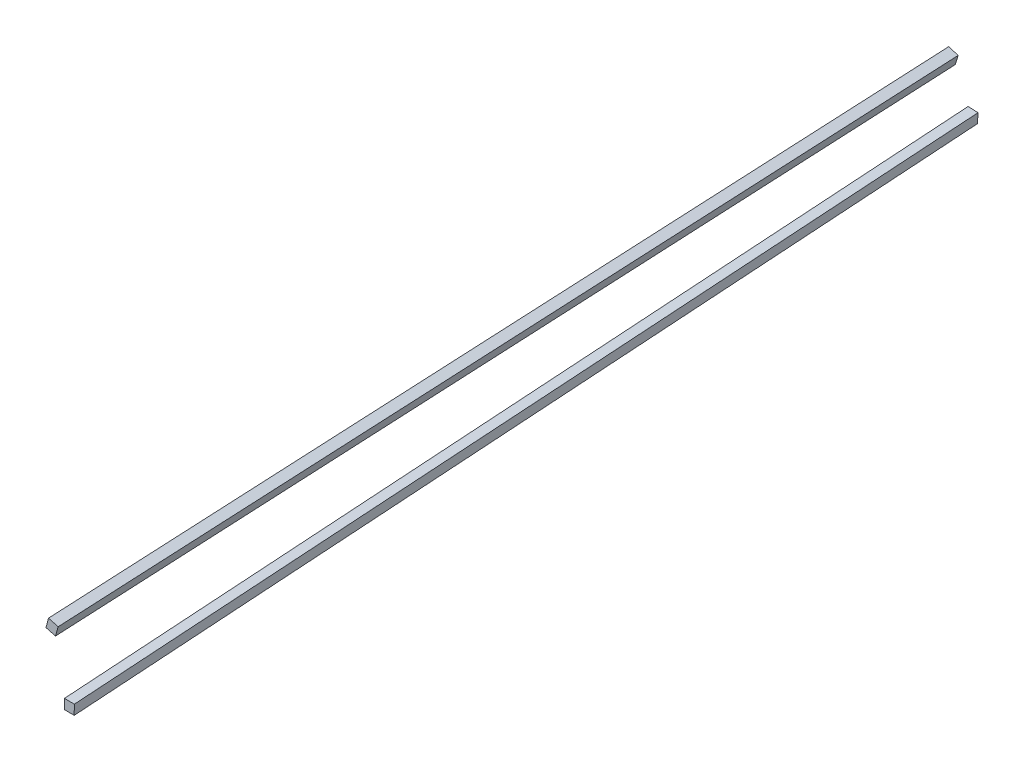
ISO-10303-21;
HEADER;
FILE_DESCRIPTION(('STEP AP214'),'2;1');
FILE_NAME('part.step','',(''),(''),'','','');
FILE_SCHEMA(('AUTOMOTIVE_DESIGN { 1 0 10303 214 1 1 1 1 }'));
ENDSEC;
DATA;
#1=APPLICATION_CONTEXT('core data for automotive mechanical design processes');
#2=APPLICATION_PROTOCOL_DEFINITION('international standard','automotive_design',2000,#1);
#3=PRODUCT_CONTEXT('',#1,'mechanical');
#4=PRODUCT('Part','Part','',(#3));
#5=PRODUCT_RELATED_PRODUCT_CATEGORY('part','',(#4));
#6=PRODUCT_DEFINITION_FORMATION('','',#4);
#7=PRODUCT_DEFINITION_CONTEXT('part definition',#1,'design');
#8=PRODUCT_DEFINITION('design','',#6,#7);
#9=PRODUCT_DEFINITION_SHAPE('','',#8);
#10=(LENGTH_UNIT() NAMED_UNIT(*) SI_UNIT(.MILLI.,.METRE.));
#11=(NAMED_UNIT(*) PLANE_ANGLE_UNIT() SI_UNIT($,.RADIAN.));
#12=(NAMED_UNIT(*) SI_UNIT($,.STERADIAN.) SOLID_ANGLE_UNIT());
#13=UNCERTAINTY_MEASURE_WITH_UNIT(LENGTH_MEASURE(1.E-05),#10,'distance_accuracy_value','');
#14=(GEOMETRIC_REPRESENTATION_CONTEXT(3) GLOBAL_UNCERTAINTY_ASSIGNED_CONTEXT((#13)) GLOBAL_UNIT_ASSIGNED_CONTEXT((#10,
#11,#12)) REPRESENTATION_CONTEXT('',''));
#15=CARTESIAN_POINT('',(0.,0.,0.));
#16=DIRECTION('',(0.,0.,1.));
#17=DIRECTION('',(1.,0.,0.));
#18=AXIS2_PLACEMENT_3D('',#15,#16,#17);
#19=CARTESIAN_POINT('',(0.,0.,0.));
#20=DIRECTION('',(0.,0.,1.));
#21=DIRECTION('',(1.,0.,0.));
#22=AXIS2_PLACEMENT_3D('',#19,#20,#21);
#23=PLANE('',#22);
#24=DIRECTION('',(0.00252070514793132,0.999996823017732,0.));
#25=VECTOR('',#24,1.);
#26=CARTESIAN_POINT('',(395.275920508097,-0.996377213150789,0.));
#27=LINE('',#26,#25);
#28=CARTESIAN_POINT('',(395.301483034451,9.1446125664428,0.));
#29=VERTEX_POINT('',#28);
#30=CARTESIAN_POINT('',(395.313487892718,13.9070974360647,0.));
#31=VERTEX_POINT('',#30);
#32=EDGE_CURVE('E201',#29,#31,#27,.T.);
#33=ORIENTED_EDGE('',*,*,#32,.F.);
#34=DIRECTION('',(0.999965529050152,-0.00830305434461807,0.));
#35=VECTOR('',#34,1.);
#36=CARTESIAN_POINT('',(0.103177963259466,12.4260786856039,0.));
#37=LINE('',#36,#35);
#38=CARTESIAN_POINT('',(400.008751573171,9.10552651261769,0.));
#39=VERTEX_POINT('',#38);
#40=EDGE_CURVE('E192',#29,#39,#37,.T.);
#41=ORIENTED_EDGE('',*,*,#40,.T.);
#42=DIRECTION('',(-0.0141001954259366,-0.999900587303033,0.));
#43=VECTOR('',#42,1.);
#44=CARTESIAN_POINT('',(399.800846689086,-5.63783054171023,0.));
#45=LINE('',#44,#43);
#46=CARTESIAN_POINT('',(400.075514439656,13.8399452487994,0.));
#47=VERTEX_POINT('',#46);
#48=EDGE_CURVE('E79',#47,#39,#45,.T.);
#49=ORIENTED_EDGE('',*,*,#48,.F.);
#50=DIRECTION('',(0.999900587283641,-0.0141001968011182,0.));
#51=VECTOR('',#50,1.);
#52=CARTESIAN_POINT('',(0.27466778511257,19.4777763399853,0.));
#53=LINE('',#52,#51);
#54=EDGE_CURVE('E13',#31,#47,#53,.T.);
#55=ORIENTED_EDGE('',*,*,#54,.F.);
#56=EDGE_LOOP('',(#33,#41,#49,#55));
#57=FACE_BOUND('',#56,.T.);
#58=ADVANCED_FACE('F69',(#57),#23,.T.);
#59=CARTESIAN_POINT('',(0.,0.,-469.138));
#60=DIRECTION('',(0.,0.,-1.));
#61=DIRECTION('',(-1.,0.,0.));
#62=AXIS2_PLACEMENT_3D('',#59,#60,#61);
#63=PLANE('',#62);
#64=DIRECTION('',(0.998967174367176,-0.0454376995110807,0.));
#65=VECTOR('',#64,1.);
#66=CARTESIAN_POINT('',(1.06775208378096,23.4749842869842,-469.138));
#67=LINE('',#66,#65);
#68=CARTESIAN_POINT('',(363.552889379196,6.98746480852441,-469.138));
#69=VERTEX_POINT('',#68);
#70=CARTESIAN_POINT('',(368.242335537775,6.7741668636307,-469.138));
#71=VERTEX_POINT('',#70);
#72=EDGE_CURVE('E176',#69,#71,#67,.T.);
#73=ORIENTED_EDGE('',*,*,#72,.F.);
#74=DIRECTION('',(-0.0382444718636745,-0.999268412575855,0.));
#75=VECTOR('',#74,1.);
#76=CARTESIAN_POINT('',(362.754106118498,-13.8834961961015,-469.138));
#77=LINE('',#76,#75);
#78=CARTESIAN_POINT('',(363.735028676447,11.7464806234169,-469.138));
#79=VERTEX_POINT('',#78);
#80=EDGE_CURVE('E135',#79,#69,#77,.T.);
#81=ORIENTED_EDGE('',*,*,#80,.F.);
#82=DIRECTION('',(-0.998616895522125,0.0525765725181267,0.));
#83=VECTOR('',#82,1.);
#84=CARTESIAN_POINT('',(1.62220677600214,30.8115005782795,-469.138));
#85=LINE('',#84,#83);
#86=CARTESIAN_POINT('',(368.490941641371,11.4960846967993,-469.138));
#87=VERTEX_POINT('',#86);
#88=EDGE_CURVE('E114',#87,#79,#85,.T.);
#89=ORIENTED_EDGE('',*,*,#88,.F.);
#90=DIRECTION('',(0.0525765725181391,0.998616895522124,0.));
#91=VECTOR('',#90,1.);
#92=CARTESIAN_POINT('',(366.868734865368,-19.3154158814847,-469.138));
#93=LINE('',#92,#91);
#94=EDGE_CURVE('E119',#71,#87,#93,.T.);
#95=ORIENTED_EDGE('',*,*,#94,.F.);
#96=EDGE_LOOP('',(#73,#81,#89,#95));
#97=FACE_BOUND('',#96,.T.);
#98=ADVANCED_FACE('F134',(#97),#63,.T.);
#99=CARTESIAN_POINT('',(368.490941641371,11.4960846967993,-469.138));
#100=CARTESIAN_POINT('',(400.075514439656,13.8399452487994,0.));
#101=CARTESIAN_POINT('',(367.69828948055,11.5378173512356,-469.138));
#102=CARTESIAN_POINT('',(399.281843348501,13.8511372800103,0.));
#103=CARTESIAN_POINT('',(366.905637319729,11.5795500056719,-469.138));
#104=CARTESIAN_POINT('',(398.488172257344,13.8623293112212,0.));
#105=CARTESIAN_POINT('',(365.320332998087,11.6630153145444,-469.138));
#106=CARTESIAN_POINT('',(396.900830075032,13.884713373643,0.));
#107=CARTESIAN_POINT('',(364.527680837267,11.7047479689807,-469.138));
#108=CARTESIAN_POINT('',(396.107158983875,13.8959054048538,0.));
#109=CARTESIAN_POINT('',(363.735028676447,11.7464806234169,-469.138));
#110=CARTESIAN_POINT('',(395.313487892718,13.9070974360647,0.));
#111=B_SPLINE_SURFACE_WITH_KNOTS('',3,1,((#99,#100),(#101,#102),(#103,#104),(#105,#106),(#107,
#108),(#109,#110)),.UNSPECIFIED.,.F.,.F.,.F.,(4,2,4),(2,2),(0.,0.5,1.),(0.,1.),.UNSPECIFIED.);
#112=DIRECTION('',(0.0671589808969115,0.00459505710055014,0.99773170578825));
#113=VECTOR('',#112,1.);
#114=CARTESIAN_POINT('',(379.524258284582,12.8267890297408,-234.569));
#115=LINE('',#114,#113);
#116=EDGE_CURVE('E118',#79,#31,#115,.T.);
#117=DIRECTION('',(-0.0671717988112607,-0.00498475412177002,-0.997728972051431));
#118=VECTOR('',#117,1.);
#119=CARTESIAN_POINT('',(384.283228040514,12.6680149727994,-234.569));
#120=LINE('',#119,#118);
#121=EDGE_CURVE('E94',#47,#87,#120,.T.);
#122=ORIENTED_EDGE('',*,*,#88,.T.);
#123=ORIENTED_EDGE('',*,*,#116,.T.);
#124=ORIENTED_EDGE('',*,*,#54,.T.);
#125=ORIENTED_EDGE('',*,*,#121,.T.);
#126=EDGE_LOOP('',(#122,#123,#124,#125));
#127=FACE_BOUND('',#126,.T.);
#128=ADVANCED_FACE('F111',(#127),#111,.T.);
#129=CARTESIAN_POINT('',(363.735028676447,11.7464806234169,-469.138));
#130=CARTESIAN_POINT('',(395.313487892718,13.9070974360647,0.));
#131=CARTESIAN_POINT('',(363.704672126905,10.9533113209348,-469.138));
#132=CARTESIAN_POINT('',(395.311487083007,13.1133499577944,0.));
#133=CARTESIAN_POINT('',(363.674315577363,10.1601420184528,-469.138));
#134=CARTESIAN_POINT('',(395.309486273296,12.3196024795241,0.));
#135=CARTESIAN_POINT('',(363.613602478279,8.57380341348858,-469.138));
#136=CARTESIAN_POINT('',(395.305484653873,10.7321075229834,0.));
#137=CARTESIAN_POINT('',(363.583245928738,7.7806341110065,-469.138));
#138=CARTESIAN_POINT('',(395.303483844162,9.9383600447131,0.));
#139=CARTESIAN_POINT('',(363.552889379196,6.98746480852441,-469.138));
#140=CARTESIAN_POINT('',(395.301483034451,9.1446125664428,0.));
#141=B_SPLINE_SURFACE_WITH_KNOTS('',3,1,((#129,#130),(#131,#132),(#133,#134),(#135,#136),(#137,
#138),(#139,#140)),.UNSPECIFIED.,.F.,.F.,.F.,(4,2,4),(2,2),(0.,0.5,1.),(0.,1.),.UNSPECIFIED.);
#142=DIRECTION('',(0.067519168741487,0.0045875677218573,0.997707430099052));
#143=VECTOR('',#142,1.);
#144=CARTESIAN_POINT('',(379.427186206823,8.0660386874836,-234.569));
#145=LINE('',#144,#143);
#146=EDGE_CURVE('E208',#69,#29,#145,.T.);
#147=ORIENTED_EDGE('',*,*,#80,.T.);
#148=ORIENTED_EDGE('',*,*,#146,.T.);
#149=ORIENTED_EDGE('',*,*,#32,.T.);
#150=ORIENTED_EDGE('',*,*,#116,.F.);
#151=EDGE_LOOP('',(#147,#148,#149,#150));
#152=FACE_BOUND('',#151,.T.);
#153=ADVANCED_FACE('F259',(#152),#141,.T.);
#154=CARTESIAN_POINT('',(368.242335537775,6.7741668636307,-469.138));
#155=CARTESIAN_POINT('',(400.008751573171,9.10552651261769,0.));
#156=CARTESIAN_POINT('',(368.283769888375,7.56115316915884,-469.138));
#157=CARTESIAN_POINT('',(400.019878717586,9.89459630198132,0.));
#158=CARTESIAN_POINT('',(368.325204238974,8.34813947468696,-469.138));
#159=CARTESIAN_POINT('',(400.031005862,10.6836660913449,0.));
#160=CARTESIAN_POINT('',(368.408072940172,9.92211208574317,-469.138));
#161=CARTESIAN_POINT('',(400.053260150828,12.2618056700722,0.));
#162=CARTESIAN_POINT('',(368.449507290771,10.7090983912713,-469.138));
#163=CARTESIAN_POINT('',(400.064387295242,13.0508754594358,0.));
#164=CARTESIAN_POINT('',(368.490941641371,11.4960846967993,-469.138));
#165=CARTESIAN_POINT('',(400.075514439656,13.8399452487994,0.));
#166=B_SPLINE_SURFACE_WITH_KNOTS('',3,1,((#154,#155),(#156,#157),(#158,#159),(#160,#161),(#162,
#163),(#164,#165)),.UNSPECIFIED.,.F.,.F.,.F.,(4,2,4),(2,2),(0.,0.5,1.),(0.,1.),.UNSPECIFIED.);
#167=DIRECTION('',(0.067556778883899,0.0049580395891671,0.997703111887632));
#168=VECTOR('',#167,1.);
#169=CARTESIAN_POINT('',(384.125543555472,7.93984668809458,-234.569));
#170=LINE('',#169,#168);
#171=EDGE_CURVE('E125',#71,#39,#170,.T.);
#172=ORIENTED_EDGE('',*,*,#94,.T.);
#173=ORIENTED_EDGE('',*,*,#121,.F.);
#174=ORIENTED_EDGE('',*,*,#48,.T.);
#175=ORIENTED_EDGE('',*,*,#171,.F.);
#176=EDGE_LOOP('',(#172,#173,#174,#175));
#177=FACE_BOUND('',#176,.T.);
#178=ADVANCED_FACE('F123',(#177),#166,.T.);
#179=CARTESIAN_POINT('',(363.552889387363,6.98746480821184,-469.138));
#180=CARTESIAN_POINT('',(395.301483034451,9.1446125664428,0.));
#181=CARTESIAN_POINT('',(364.334463745764,6.95191515077178,-469.138));
#182=CARTESIAN_POINT('',(396.086027790904,9.13809822413861,0.));
#183=CARTESIAN_POINT('',(365.116038104166,6.91636549333171,-469.138));
#184=CARTESIAN_POINT('',(396.870572547357,9.13158388183443,0.));
#185=CARTESIAN_POINT('',(366.679186820969,6.84526617845159,-469.138));
#186=CARTESIAN_POINT('',(398.439662060264,9.11855519722606,0.));
#187=CARTESIAN_POINT('',(367.460761179371,6.80971652101153,-469.138));
#188=CARTESIAN_POINT('',(399.224206816718,9.11204085492187,0.));
#189=CARTESIAN_POINT('',(368.242335537773,6.77416686357147,-469.138));
#190=CARTESIAN_POINT('',(400.008751573171,9.10552651261769,0.));
#191=B_SPLINE_SURFACE_WITH_KNOTS('',3,1,((#179,#180),(#181,#182),(#183,#184),(#185,#186),(#187,
#188),(#189,#190)),.UNSPECIFIED.,.F.,.F.,.F.,(4,2,4),(2,2),(0.,0.5,1.),(0.,1.),.UNSPECIFIED.);
#192=ORIENTED_EDGE('',*,*,#72,.T.);
#193=ORIENTED_EDGE('',*,*,#171,.T.);
#194=ORIENTED_EDGE('',*,*,#40,.F.);
#195=ORIENTED_EDGE('',*,*,#146,.F.);
#196=EDGE_LOOP('',(#192,#193,#194,#195));
#197=FACE_BOUND('',#196,.T.);
#198=ADVANCED_FACE('F219',(#197),#191,.T.);
#199=CLOSED_SHELL('',(#58,#98,#128,#153,#178,#198));
#200=MANIFOLD_SOLID_BREP('B2',#199);
#201=CARTESIAN_POINT('',(0.,0.,0.));
#202=DIRECTION('',(0.,0.,1.));
#203=DIRECTION('',(1.,0.,0.));
#204=AXIS2_PLACEMENT_3D('',#201,#202,#203);
#205=PLANE('',#204);
#206=DIRECTION('',(0.964158386748643,-0.265327354907582,0.));
#207=VECTOR('',#206,1.);
#208=CARTESIAN_POINT('',(38.4596728486351,139.756476076643,0.));
#209=LINE('',#208,#207);
#210=CARTESIAN_POINT('',(387.592146781905,43.6784902454578,0.));
#211=VERTEX_POINT('',#210);
#212=CARTESIAN_POINT('',(392.246798260659,42.3975737675759,0.));
#213=VERTEX_POINT('',#212);
#214=EDGE_CURVE('E536',#211,#213,#209,.T.);
#215=ORIENTED_EDGE('',*,*,#214,.F.);
#216=DIRECTION('',(-0.258697646743091,-0.965958346705274,0.));
#217=VECTOR('',#216,1.);
#218=CARTESIAN_POINT('',(350.737878632664,-93.9326878176648,0.));
#219=LINE('',#218,#217);
#220=CARTESIAN_POINT('',(386.360099239292,39.078113619274,0.));
#221=VERTEX_POINT('',#220);
#222=EDGE_CURVE('E528',#211,#221,#219,.T.);
#223=ORIENTED_EDGE('',*,*,#222,.T.);
#224=DIRECTION('',(0.965958346178041,-0.258697648711744,0.));
#225=VECTOR('',#224,1.);
#226=CARTESIAN_POINT('',(35.6222210691455,133.010802079154,0.));
#227=LINE('',#226,#225);
#228=CARTESIAN_POINT('',(390.960475862964,37.8460660672843,0.));
#229=VERTEX_POINT('',#228);
#230=EDGE_CURVE('E412',#221,#229,#227,.T.);
#231=ORIENTED_EDGE('',*,*,#230,.T.);
#232=DIRECTION('',(0.27196224125837,0.962307923343523,0.));
#233=VECTOR('',#232,1.);
#234=CARTESIAN_POINT('',(352.138938405598,-99.5195951316532,0.));
#235=LINE('',#234,#233);
#236=EDGE_CURVE('E67',#229,#213,#235,.T.);
#237=ORIENTED_EDGE('',*,*,#236,.T.);
#238=EDGE_LOOP('',(#215,#223,#231,#237));
#239=FACE_BOUND('',#238,.T.);
#240=ADVANCED_FACE('F402',(#239),#205,.T.);
#241=CARTESIAN_POINT('',(0.,0.,-469.138));
#242=DIRECTION('',(0.,0.,-1.));
#243=DIRECTION('',(-1.,0.,0.));
#244=AXIS2_PLACEMENT_3D('',#241,#242,#243);
#245=PLANE('',#244);
#246=DIRECTION('',(-0.954890949785485,0.296956687107351,0.));
#247=VECTOR('',#246,1.);
#248=CARTESIAN_POINT('',(40.3544143820575,129.763250838631,-469.138));
#249=LINE('',#248,#247);
#250=CARTESIAN_POINT('',(358.868671815921,30.7101194781685,-469.138));
#251=VERTEX_POINT('',#250);
#252=CARTESIAN_POINT('',(354.32083743442,32.1244273965907,-469.138));
#253=VERTEX_POINT('',#252);
#254=EDGE_CURVE('E512',#251,#253,#249,.T.);
#255=ORIENTED_EDGE('',*,*,#254,.F.);
#256=DIRECTION('',(0.288781339152301,0.957395079451218,0.));
#257=VECTOR('',#256,1.);
#258=CARTESIAN_POINT('',(320.450273001149,-96.6581727389244,-469.138));
#259=LINE('',#258,#257);
#260=CARTESIAN_POINT('',(357.505110372594,26.1895122029914,-469.138));
#261=VERTEX_POINT('',#260);
#262=EDGE_CURVE('E470',#261,#251,#259,.T.);
#263=ORIENTED_EDGE('',*,*,#262,.F.);
#264=DIRECTION('',(0.95739507945121,-0.288781339152327,0.));
#265=VECTOR('',#264,1.);
#266=CARTESIAN_POINT('',(37.0548373714508,122.847684941924,-469.138));
#267=LINE('',#266,#265);
#268=CARTESIAN_POINT('',(352.945516306707,27.5648333307043,-469.138));
#269=VERTEX_POINT('',#268);
#270=EDGE_CURVE('E448',#269,#261,#267,.T.);
#271=ORIENTED_EDGE('',*,*,#270,.F.);
#272=DIRECTION('',(-0.288781339152282,-0.957395079451223,0.));
#273=VECTOR('',#272,1.);
#274=CARTESIAN_POINT('',(315.890678935267,-95.2828516112063,-469.138));
#275=LINE('',#274,#273);
#276=EDGE_CURVE('E456',#253,#269,#275,.T.);
#277=ORIENTED_EDGE('',*,*,#276,.F.);
#278=EDGE_LOOP('',(#255,#263,#271,#277));
#279=FACE_BOUND('',#278,.T.);
#280=ADVANCED_FACE('F469',(#279),#245,.T.);
#281=CARTESIAN_POINT('',(358.868671815921,30.7101194781685,-469.138));
#282=CARTESIAN_POINT('',(392.246798260659,42.3975737675759,0.));
#283=CARTESIAN_POINT('',(358.110699419001,30.9458374645614,-469.138));
#284=CARTESIAN_POINT('',(391.4710230142,42.611059847223,0.));
#285=CARTESIAN_POINT('',(357.35272702208,31.1815554509543,-469.138));
#286=CARTESIAN_POINT('',(390.695247767741,42.82454592687,0.));
#287=CARTESIAN_POINT('',(355.83678222824,31.6529914237401,-469.138));
#288=CARTESIAN_POINT('',(389.143697274823,43.251518086164,0.));
#289=CARTESIAN_POINT('',(355.07880983132,31.888709410133,-469.138));
#290=CARTESIAN_POINT('',(388.367922028364,43.4650041658109,0.));
#291=CARTESIAN_POINT('',(354.3208374344,32.1244273965259,-469.138));
#292=CARTESIAN_POINT('',(387.592146781905,43.6784902454578,0.));
#293=B_SPLINE_SURFACE_WITH_KNOTS('',3,1,((#281,#282),(#283,#284),(#285,#286),(#287,#288),(#289,
#290),(#291,#292)),.UNSPECIFIED.,.F.,.F.,.F.,(4,2,4),(2,2),(0.,0.5,1.),(0.,1.),.UNSPECIFIED.);
#294=DIRECTION('',(0.0707210709308886,0.0245591686742715,0.997193751163943));
#295=VECTOR('',#294,1.);
#296=CARTESIAN_POINT('',(370.956492108153,37.9014588209918,-234.569));
#297=LINE('',#296,#295);
#298=EDGE_CURVE('E453',#253,#211,#297,.T.);
#299=DIRECTION('',(-0.0709464821029257,-0.0248421303078536,-0.997170730235794));
#300=VECTOR('',#299,1.);
#301=CARTESIAN_POINT('',(375.55773503829,36.5538466228722,-234.569));
#302=LINE('',#301,#300);
#303=EDGE_CURVE('E464',#213,#251,#302,.T.);
#304=ORIENTED_EDGE('',*,*,#254,.T.);
#305=ORIENTED_EDGE('',*,*,#298,.T.);
#306=ORIENTED_EDGE('',*,*,#214,.T.);
#307=ORIENTED_EDGE('',*,*,#303,.T.);
#308=EDGE_LOOP('',(#304,#305,#306,#307));
#309=FACE_BOUND('',#308,.T.);
#310=ADVANCED_FACE('F489',(#309),#293,.T.);
#311=CARTESIAN_POINT('',(354.32083743442,32.1244273965907,-469.138));
#312=CARTESIAN_POINT('',(387.592146781905,43.6784902454578,0.));
#313=CARTESIAN_POINT('',(354.091617246468,31.3644950522763,-469.138));
#314=CARTESIAN_POINT('',(387.386805524803,42.9117608077606,0.));
#315=CARTESIAN_POINT('',(353.862397058516,30.6045627079619,-469.138));
#316=CARTESIAN_POINT('',(387.181464267701,42.1450313700633,0.));
#317=CARTESIAN_POINT('',(353.403956682611,29.0846980193331,-469.138));
#318=CARTESIAN_POINT('',(386.770781753496,40.6115724946687,0.));
#319=CARTESIAN_POINT('',(353.174736494659,28.3247656750187,-469.138));
#320=CARTESIAN_POINT('',(386.565440496394,39.8448430569714,0.));
#321=CARTESIAN_POINT('',(352.945516306707,27.5648333307044,-469.138));
#322=CARTESIAN_POINT('',(386.360099239292,39.078113619274,0.));
#323=B_SPLINE_SURFACE_WITH_KNOTS('',3,1,((#311,#312),(#313,#314),(#315,#316),(#317,#318),(#319,
#320),(#321,#322)),.UNSPECIFIED.,.F.,.F.,.F.,(4,2,4),(2,2),(0.,0.5,1.),(0.,1.),.UNSPECIFIED.);
#324=DIRECTION('',(0.0710242294177518,0.0244720055975575,0.997174347733458));
#325=VECTOR('',#324,1.);
#326=CARTESIAN_POINT('',(369.652807772999,33.3214734749892,-234.569));
#327=LINE('',#326,#325);
#328=EDGE_CURVE('E444',#269,#221,#327,.T.);
#329=ORIENTED_EDGE('',*,*,#276,.T.);
#330=ORIENTED_EDGE('',*,*,#328,.T.);
#331=ORIENTED_EDGE('',*,*,#222,.F.);
#332=ORIENTED_EDGE('',*,*,#298,.F.);
#333=EDGE_LOOP('',(#329,#330,#331,#332));
#334=FACE_BOUND('',#333,.T.);
#335=ADVANCED_FACE('F458',(#334),#323,.T.);
#336=CARTESIAN_POINT('',(357.505110372593,26.1895122029915,-469.138));
#337=CARTESIAN_POINT('',(390.960475862964,37.8460660672843,0.));
#338=CARTESIAN_POINT('',(357.732370614159,26.9429467485494,-469.138));
#339=CARTESIAN_POINT('',(391.174862929247,38.6046506839998,0.));
#340=CARTESIAN_POINT('',(357.959630855725,27.6963812941073,-469.138));
#341=CARTESIAN_POINT('',(391.389249995529,39.3632353007152,0.));
#342=CARTESIAN_POINT('',(358.414151338856,29.203250385223,-469.138));
#343=CARTESIAN_POINT('',(391.818024128094,40.8804045341457,0.));
#344=CARTESIAN_POINT('',(358.641411580422,29.9566849307809,-469.138));
#345=CARTESIAN_POINT('',(392.032411194377,41.6389891508608,0.));
#346=CARTESIAN_POINT('',(358.868671821987,30.7101194763388,-469.138));
#347=CARTESIAN_POINT('',(392.246798260659,42.3975737675759,0.));
#348=B_SPLINE_SURFACE_WITH_KNOTS('',3,1,((#336,#337),(#338,#339),(#340,#341),(#342,#343),(#344,
#345),(#346,#347)),.UNSPECIFIED.,.F.,.F.,.F.,(4,2,4),(2,2),(0.,0.5,1.),(0.,1.),.UNSPECIFIED.);
#349=DIRECTION('',(0.0711099432998514,0.0247762017306346,0.997160727160719));
#350=VECTOR('',#349,1.);
#351=CARTESIAN_POINT('',(374.232793117779,32.0177891351379,-234.569));
#352=LINE('',#351,#350);
#353=EDGE_CURVE('E427',#261,#229,#352,.T.);
#354=ORIENTED_EDGE('',*,*,#262,.T.);
#355=ORIENTED_EDGE('',*,*,#303,.F.);
#356=ORIENTED_EDGE('',*,*,#236,.F.);
#357=ORIENTED_EDGE('',*,*,#353,.F.);
#358=EDGE_LOOP('',(#354,#355,#356,#357));
#359=FACE_BOUND('',#358,.T.);
#360=ADVANCED_FACE('F568',(#359),#348,.T.);
#361=CARTESIAN_POINT('',(352.945516306707,27.5648333307043,-469.138));
#362=CARTESIAN_POINT('',(386.360099239292,39.0781136192739,0.));
#363=CARTESIAN_POINT('',(353.705448651022,27.3356131427522,-469.138));
#364=CARTESIAN_POINT('',(387.126828676571,38.8727723606088,0.));
#365=CARTESIAN_POINT('',(354.465380995336,27.1063929548,-469.138));
#366=CARTESIAN_POINT('',(387.89355811385,38.6674311019438,0.));
#367=CARTESIAN_POINT('',(355.985245683965,26.6479525788957,-469.138));
#368=CARTESIAN_POINT('',(389.427016988408,38.256748584614,0.));
#369=CARTESIAN_POINT('',(356.745178028279,26.4187323909436,-469.138));
#370=CARTESIAN_POINT('',(390.193746425686,38.0514073259491,0.));
#371=CARTESIAN_POINT('',(357.505110372594,26.1895122029914,-469.138));
#372=CARTESIAN_POINT('',(390.960475862964,37.8460660672843,0.));
#373=B_SPLINE_SURFACE_WITH_KNOTS('',3,1,((#361,#362),(#363,#364),(#365,#366),(#367,#368),(#369,
#370),(#371,#372)),.UNSPECIFIED.,.F.,.F.,.F.,(4,2,4),(2,2),(0.,0.5,1.),(0.,1.),.UNSPECIFIED.);
#374=ORIENTED_EDGE('',*,*,#270,.T.);
#375=ORIENTED_EDGE('',*,*,#353,.T.);
#376=ORIENTED_EDGE('',*,*,#230,.F.);
#377=ORIENTED_EDGE('',*,*,#328,.F.);
#378=EDGE_LOOP('',(#374,#375,#376,#377));
#379=FACE_BOUND('',#378,.T.);
#380=ADVANCED_FACE('F446',(#379),#373,.T.);
#381=CLOSED_SHELL('',(#240,#280,#310,#335,#360,#380));
#382=MANIFOLD_SOLID_BREP('B7',#381);
#383=ADVANCED_BREP_SHAPE_REPRESENTATION('',(#18,#200,#382),#14);
#384=SHAPE_DEFINITION_REPRESENTATION(#9,#383);
ENDSEC;
END-ISO-10303-21;
